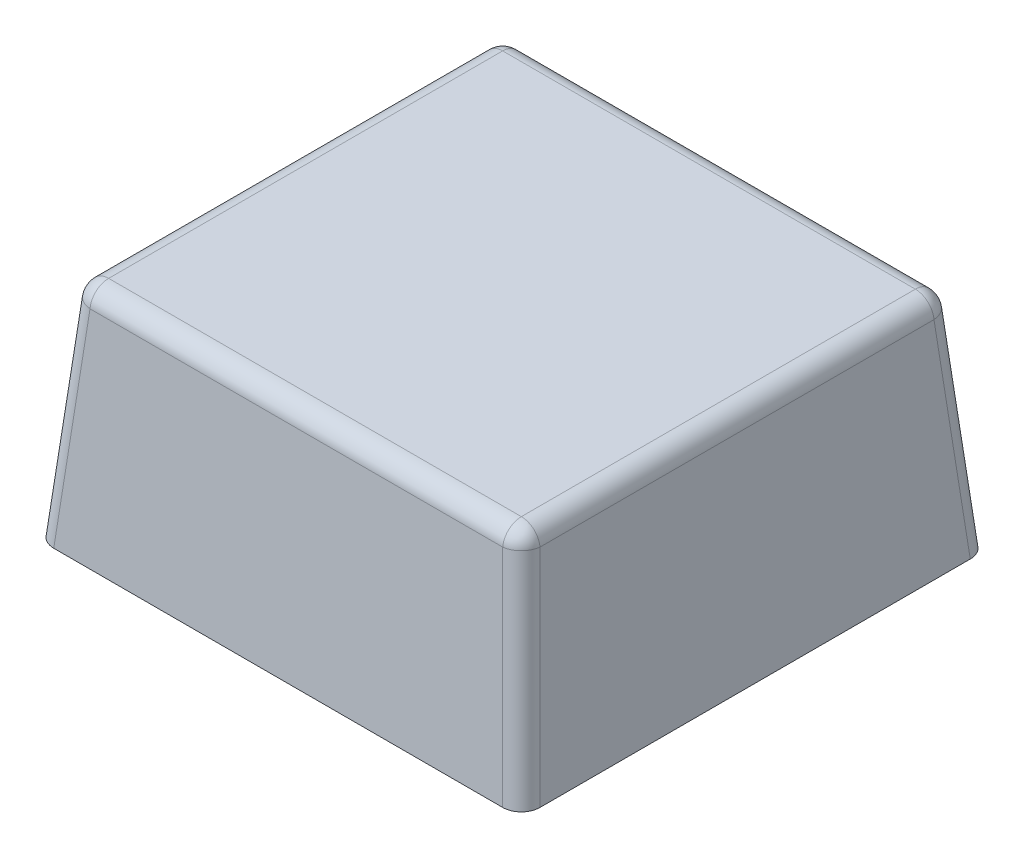
ISO-10303-21;
HEADER;
FILE_DESCRIPTION(('STEP AP214'),'2;1');
FILE_NAME('part.step','',(''),(''),'','','');
FILE_SCHEMA(('AUTOMOTIVE_DESIGN { 1 0 10303 214 1 1 1 1 }'));
ENDSEC;
DATA;
#1=APPLICATION_CONTEXT('core data for automotive mechanical design processes');
#2=APPLICATION_PROTOCOL_DEFINITION('international standard','automotive_design',2000,#1);
#3=PRODUCT_CONTEXT('',#1,'mechanical');
#4=PRODUCT('Part','Part','',(#3));
#5=PRODUCT_RELATED_PRODUCT_CATEGORY('part','',(#4));
#6=PRODUCT_DEFINITION_FORMATION('','',#4);
#7=PRODUCT_DEFINITION_CONTEXT('part definition',#1,'design');
#8=PRODUCT_DEFINITION('design','',#6,#7);
#9=PRODUCT_DEFINITION_SHAPE('','',#8);
#10=(LENGTH_UNIT() NAMED_UNIT(*) SI_UNIT(.MILLI.,.METRE.));
#11=(NAMED_UNIT(*) PLANE_ANGLE_UNIT() SI_UNIT($,.RADIAN.));
#12=(NAMED_UNIT(*) SI_UNIT($,.STERADIAN.) SOLID_ANGLE_UNIT());
#13=UNCERTAINTY_MEASURE_WITH_UNIT(LENGTH_MEASURE(1.E-05),#10,'distance_accuracy_value','');
#14=(GEOMETRIC_REPRESENTATION_CONTEXT(3) GLOBAL_UNCERTAINTY_ASSIGNED_CONTEXT((#13)) GLOBAL_UNIT_ASSIGNED_CONTEXT((#10,
#11,#12)) REPRESENTATION_CONTEXT('',''));
#15=CARTESIAN_POINT('',(0.,0.,0.));
#16=DIRECTION('',(0.,0.,1.));
#17=DIRECTION('',(1.,0.,0.));
#18=AXIS2_PLACEMENT_3D('',#15,#16,#17);
#19=CARTESIAN_POINT('',(0.,0.85,-0.526690243184));
#20=DIRECTION('',(-1.,0.,0.));
#21=DIRECTION('',(0.,0.,1.));
#22=AXIS2_PLACEMENT_3D('',#19,#20,#21);
#23=CYLINDRICAL_SURFACE('',#22,0.05);
#24=CARTESIAN_POINT('',(0.551690243184,0.85,-0.526690243184));
#25=DIRECTION('',(-1.,0.,0.));
#26=DIRECTION('',(0.,0.,-1.));
#27=AXIS2_PLACEMENT_3D('',#24,#25,#26);
#28=CIRCLE('',#27,0.05);
#29=CARTESIAN_POINT('',(0.551690243184,0.9,-0.526690243184));
#30=VERTEX_POINT('',#29);
#31=CARTESIAN_POINT('',(0.551690243184,0.854357787137,-0.576499978088));
#32=VERTEX_POINT('',#31);
#33=EDGE_CURVE('E20',#30,#32,#28,.T.);
#34=ORIENTED_EDGE('',*,*,#33,.T.);
#35=DIRECTION('',(1.,0.,0.));
#36=VECTOR('',#35,1.);
#37=CARTESIAN_POINT('',(0.597506801884,0.854357787137,-0.576499978088));
#38=LINE('',#37,#36);
#39=CARTESIAN_POINT('',(-0.551690243184,0.854357787137,-0.576499978088));
#40=VERTEX_POINT('',#39);
#41=EDGE_CURVE('E132',#40,#32,#38,.T.);
#42=ORIENTED_EDGE('',*,*,#41,.F.);
#43=CARTESIAN_POINT('',(-0.551690243184,0.85,-0.526690243184));
#44=DIRECTION('',(1.,0.,0.));
#45=DIRECTION('',(0.,0.,1.));
#46=AXIS2_PLACEMENT_3D('',#43,#44,#45);
#47=CIRCLE('',#46,0.05);
#48=CARTESIAN_POINT('',(-0.551690243184,0.9,-0.526690243184));
#49=VERTEX_POINT('',#48);
#50=EDGE_CURVE('E11',#40,#49,#47,.T.);
#51=ORIENTED_EDGE('',*,*,#50,.T.);
#52=DIRECTION('',(-1.,0.,0.));
#53=VECTOR('',#52,1.);
#54=CARTESIAN_POINT('',(-0.597506801884,0.9,-0.526690243184));
#55=LINE('',#54,#53);
#56=EDGE_CURVE('E114',#30,#49,#55,.T.);
#57=ORIENTED_EDGE('',*,*,#56,.F.);
#58=EDGE_LOOP('',(#34,#42,#51,#57));
#59=FACE_BOUND('',#58,.T.);
#60=ADVANCED_FACE('F17',(#59),#23,.T.);
#61=CARTESIAN_POINT('',(-0.551690243184,0.85,-0.526690243184));
#62=DIRECTION('',(0.,1.,0.));
#63=DIRECTION('',(1.,0.,0.));
#64=AXIS2_PLACEMENT_3D('',#61,#62,#63);
#65=SPHERICAL_SURFACE('',#64,0.05);
#66=CARTESIAN_POINT('',(-0.551690243184,0.85,-0.526690243184));
#67=DIRECTION('',(0.0868265938642471,0.992432509138969,0.0868265938642274));
#68=DIRECTION('',(0.,-0.0871557427476379,0.996194698091747));
#69=AXIS2_PLACEMENT_3D('',#66,#67,#68);
#70=CIRCLE('',#69,0.05);
#71=CARTESIAN_POINT('',(-0.601499978088,0.854357787137,-0.526690243184));
#72=VERTEX_POINT('',#71);
#73=EDGE_CURVE('E100',#40,#72,#70,.T.);
#74=ORIENTED_EDGE('',*,*,#73,.T.);
#75=CARTESIAN_POINT('',(-0.551690243184,0.85,-0.526690243184));
#76=DIRECTION('',(0.,0.,-1.));
#77=DIRECTION('',(0.,1.,0.));
#78=AXIS2_PLACEMENT_3D('',#75,#76,#77);
#79=CIRCLE('',#78,0.05);
#80=EDGE_CURVE('E111',#72,#49,#79,.T.);
#81=ORIENTED_EDGE('',*,*,#80,.T.);
#82=ORIENTED_EDGE('',*,*,#50,.F.);
#83=EDGE_LOOP('',(#74,#81,#82));
#84=FACE_BOUND('',#83,.T.);
#85=ADVANCED_FACE('F321',(#84),#65,.T.);
#86=CARTESIAN_POINT('',(0.551690243184,0.85,-0.526690243184));
#87=DIRECTION('',(0.,1.,0.));
#88=DIRECTION('',(1.,0.,0.));
#89=AXIS2_PLACEMENT_3D('',#86,#87,#88);
#90=SPHERICAL_SURFACE('',#89,0.05);
#91=CARTESIAN_POINT('',(0.551690243184,0.85,-0.526690243184));
#92=DIRECTION('',(0.,0.,-1.));
#93=DIRECTION('',(-1.,0.,0.));
#94=AXIS2_PLACEMENT_3D('',#91,#92,#93);
#95=CIRCLE('',#94,0.05);
#96=CARTESIAN_POINT('',(0.601499978088,0.854357787137,-0.526690243184));
#97=VERTEX_POINT('',#96);
#98=EDGE_CURVE('E92',#30,#97,#95,.T.);
#99=ORIENTED_EDGE('',*,*,#98,.T.);
#100=CARTESIAN_POINT('',(0.551690243184,0.85,-0.526690243184));
#101=DIRECTION('',(-0.0868265938642471,0.992432509138969,0.0868265938642274));
#102=DIRECTION('',(0.,-0.0871557427476379,0.996194698091747));
#103=AXIS2_PLACEMENT_3D('',#100,#101,#102);
#104=CIRCLE('',#103,0.05);
#105=EDGE_CURVE('E94',#97,#32,#104,.T.);
#106=ORIENTED_EDGE('',*,*,#105,.T.);
#107=ORIENTED_EDGE('',*,*,#33,.F.);
#108=EDGE_LOOP('',(#99,#106,#107));
#109=FACE_BOUND('',#108,.T.);
#110=ADVANCED_FACE('F91',(#109),#90,.T.);
#111=CARTESIAN_POINT('',(-0.591142201832,0.399062049208,-0.566142201832));
#112=DIRECTION('',(-0.0868265938642274,-0.992432509138969,-0.0868265938642471));
#113=DIRECTION('',(0.996194698091747,-0.0871557427476379,0.));
#114=AXIS2_PLACEMENT_3D('',#111,#112,#113);
#115=CYLINDRICAL_SURFACE('',#114,0.05);
#116=CARTESIAN_POINT('',(-0.65,0.3,-0.575190265095));
#117=CARTESIAN_POINT('',(-0.65,0.3,-0.604413846781));
#118=CARTESIAN_POINT('',(-0.629413846781,0.3,-0.625));
#119=CARTESIAN_POINT('',(-0.600190265095,0.3,-0.625));
#120=(BOUNDED_CURVE() B_SPLINE_CURVE(3,(#116,#117,#118,#119),.UNSPECIFIED.,.F.,
.F.) B_SPLINE_CURVE_WITH_KNOTS((4,4),(5.501585242055,7.064785372304),
.UNSPECIFIED.) CURVE() GEOMETRIC_REPRESENTATION_ITEM() RATIONAL_B_SPLINE_CURVE((1.,
0.806524890385,0.806524890385,1.)) REPRESENTATION_ITEM(''));
#121=CARTESIAN_POINT('',(-0.65,0.3,-0.575190265095));
#122=VERTEX_POINT('',#121);
#123=CARTESIAN_POINT('',(-0.600190265095,0.3,-0.625));
#124=VERTEX_POINT('',#123);
#125=EDGE_CURVE('E139',#122,#124,#120,.T.);
#126=ORIENTED_EDGE('',*,*,#125,.F.);
#127=DIRECTION('',(-0.0868265938642471,-0.992432509138967,-0.0868265938642471));
#128=VECTOR('',#127,1.);
#129=CARTESIAN_POINT('',(-0.640951936736,0.403419836345,-0.566142201832));
#130=LINE('',#129,#128);
#131=EDGE_CURVE('E229',#72,#122,#130,.T.);
#132=ORIENTED_EDGE('',*,*,#131,.F.);
#133=ORIENTED_EDGE('',*,*,#73,.F.);
#134=DIRECTION('',(0.0868265938642471,0.992432509138967,0.0868265938642471));
#135=VECTOR('',#134,1.);
#136=CARTESIAN_POINT('',(-0.590765258961,0.407728313066,-0.615574993866));
#137=LINE('',#136,#135);
#138=EDGE_CURVE('E197',#124,#40,#137,.T.);
#139=ORIENTED_EDGE('',*,*,#138,.F.);
#140=EDGE_LOOP('',(#126,#132,#133,#139));
#141=FACE_BOUND('',#140,.T.);
#142=ADVANCED_FACE('F224',(#141),#115,.T.);
#143=CARTESIAN_POINT('',(-0.551690243184,0.85,0.));
#144=DIRECTION('',(0.,0.,1.));
#145=DIRECTION('',(1.,0.,0.));
#146=AXIS2_PLACEMENT_3D('',#143,#144,#145);
#147=CYLINDRICAL_SURFACE('',#146,0.05);
#148=CARTESIAN_POINT('',(-0.551690243184,0.85,0.526690243184));
#149=DIRECTION('',(0.,0.,-1.));
#150=DIRECTION('',(1.,0.,0.));
#151=AXIS2_PLACEMENT_3D('',#148,#149,#150);
#152=CIRCLE('',#151,0.05);
#153=CARTESIAN_POINT('',(-0.601499978088,0.854357787137,0.526690243184));
#154=VERTEX_POINT('',#153);
#155=CARTESIAN_POINT('',(-0.551690243184,0.9,0.526690243184));
#156=VERTEX_POINT('',#155);
#157=EDGE_CURVE('E39',#154,#156,#152,.T.);
#158=ORIENTED_EDGE('',*,*,#157,.T.);
#159=DIRECTION('',(0.,0.,1.));
#160=VECTOR('',#159,1.);
#161=CARTESIAN_POINT('',(-0.551690243184,0.9,0.572506801884));
#162=LINE('',#161,#160);
#163=EDGE_CURVE('E119',#49,#156,#162,.T.);
#164=ORIENTED_EDGE('',*,*,#163,.F.);
#165=ORIENTED_EDGE('',*,*,#80,.F.);
#166=DIRECTION('',(0.,0.,-1.));
#167=VECTOR('',#166,1.);
#168=CARTESIAN_POINT('',(-0.601499978088,0.854357787137,-0.572506801884));
#169=LINE('',#168,#167);
#170=EDGE_CURVE('E238',#154,#72,#169,.T.);
#171=ORIENTED_EDGE('',*,*,#170,.F.);
#172=EDGE_LOOP('',(#158,#164,#165,#171));
#173=FACE_BOUND('',#172,.T.);
#174=ADVANCED_FACE('F342',(#173),#147,.T.);
#175=CARTESIAN_POINT('',(0.551690243184,0.85,0.));
#176=DIRECTION('',(0.,0.,-1.));
#177=DIRECTION('',(-1.,0.,0.));
#178=AXIS2_PLACEMENT_3D('',#175,#176,#177);
#179=CYLINDRICAL_SURFACE('',#178,0.05);
#180=CARTESIAN_POINT('',(0.551690243184,0.85,0.526690243184));
#181=DIRECTION('',(0.,0.,-1.));
#182=DIRECTION('',(0.,-1.,0.));
#183=AXIS2_PLACEMENT_3D('',#180,#181,#182);
#184=CIRCLE('',#183,0.05);
#185=CARTESIAN_POINT('',(0.551690243184,0.9,0.526690243184));
#186=VERTEX_POINT('',#185);
#187=CARTESIAN_POINT('',(0.601499978088,0.854357787137,0.526690243184));
#188=VERTEX_POINT('',#187);
#189=EDGE_CURVE('E142',#186,#188,#184,.T.);
#190=ORIENTED_EDGE('',*,*,#189,.T.);
#191=DIRECTION('',(0.,0.,1.));
#192=VECTOR('',#191,1.);
#193=CARTESIAN_POINT('',(0.601499978088,0.854357787137,0.572506801884));
#194=LINE('',#193,#192);
#195=EDGE_CURVE('E108',#97,#188,#194,.T.);
#196=ORIENTED_EDGE('',*,*,#195,.F.);
#197=ORIENTED_EDGE('',*,*,#98,.F.);
#198=DIRECTION('',(0.,0.,-1.));
#199=VECTOR('',#198,1.);
#200=CARTESIAN_POINT('',(0.551690243184,0.9,-0.572506801884));
#201=LINE('',#200,#199);
#202=EDGE_CURVE('E106',#186,#30,#201,.T.);
#203=ORIENTED_EDGE('',*,*,#202,.F.);
#204=EDGE_LOOP('',(#190,#196,#197,#203));
#205=FACE_BOUND('',#204,.T.);
#206=ADVANCED_FACE('F104',(#205),#179,.T.);
#207=CARTESIAN_POINT('',(0.600565773584,0.291350131197,-0.575565773584));
#208=DIRECTION('',(0.0868265938642471,-0.992432509138969,-0.0868265938642274));
#209=DIRECTION('',(0.,0.0871557427476379,-0.996194698091747));
#210=AXIS2_PLACEMENT_3D('',#207,#208,#209);
#211=CYLINDRICAL_SURFACE('',#210,0.05);
#212=CARTESIAN_POINT('',(0.600190265095,0.3,-0.625));
#213=CARTESIAN_POINT('',(0.629413846781,0.3,-0.625));
#214=CARTESIAN_POINT('',(0.65,0.3,-0.604413846781));
#215=CARTESIAN_POINT('',(0.65,0.3,-0.575190265095));
#216=(BOUNDED_CURVE() B_SPLINE_CURVE(3,(#212,#213,#214,#215),.UNSPECIFIED.,.F.,
.F.) B_SPLINE_CURVE_WITH_KNOTS((4,4),(5.501585242055,7.064785372304),
.UNSPECIFIED.) CURVE() GEOMETRIC_REPRESENTATION_ITEM() RATIONAL_B_SPLINE_CURVE((1.,
0.806524890385,0.806524890385,1.)) REPRESENTATION_ITEM(''));
#217=CARTESIAN_POINT('',(0.600190265095,0.3,-0.625));
#218=VERTEX_POINT('',#217);
#219=CARTESIAN_POINT('',(0.65,0.3,-0.575190265095));
#220=VERTEX_POINT('',#219);
#221=EDGE_CURVE('E147',#218,#220,#216,.T.);
#222=ORIENTED_EDGE('',*,*,#221,.F.);
#223=DIRECTION('',(0.0868265938642471,-0.992432509138967,-0.0868265938642471));
#224=VECTOR('',#223,1.);
#225=CARTESIAN_POINT('',(0.600565773584,0.295707918334,-0.625375508489));
#226=LINE('',#225,#224);
#227=EDGE_CURVE('E126',#32,#218,#226,.T.);
#228=ORIENTED_EDGE('',*,*,#227,.F.);
#229=ORIENTED_EDGE('',*,*,#105,.F.);
#230=DIRECTION('',(-0.0868265938642471,0.992432509138967,0.0868265938642471));
#231=VECTOR('',#230,1.);
#232=CARTESIAN_POINT('',(0.640951936736,0.403419836345,-0.566142201832));
#233=LINE('',#232,#231);
#234=EDGE_CURVE('E201',#220,#97,#233,.T.);
#235=ORIENTED_EDGE('',*,*,#234,.F.);
#236=EDGE_LOOP('',(#222,#228,#229,#235));
#237=FACE_BOUND('',#236,.T.);
#238=ADVANCED_FACE('F353',(#237),#211,.T.);
#239=CARTESIAN_POINT('',(-0.551690243184,0.85,0.526690243184));
#240=DIRECTION('',(0.,1.,0.));
#241=DIRECTION('',(1.,0.,0.));
#242=AXIS2_PLACEMENT_3D('',#239,#240,#241);
#243=SPHERICAL_SURFACE('',#242,0.05);
#244=CARTESIAN_POINT('',(-0.551690243184,0.85,0.526690243184));
#245=DIRECTION('',(0.0868265938642471,0.992432509138969,-0.0868265938642274));
#246=DIRECTION('',(0.,0.0871557427476379,0.996194698091747));
#247=AXIS2_PLACEMENT_3D('',#244,#245,#246);
#248=CIRCLE('',#247,0.05);
#249=CARTESIAN_POINT('',(-0.551690243184,0.854357787137,0.576499978088));
#250=VERTEX_POINT('',#249);
#251=EDGE_CURVE('E176',#154,#250,#248,.T.);
#252=ORIENTED_EDGE('',*,*,#251,.T.);
#253=CARTESIAN_POINT('',(-0.551690243184,0.85,0.526690243184));
#254=DIRECTION('',(-1.,0.,0.));
#255=DIRECTION('',(0.,0.,1.));
#256=AXIS2_PLACEMENT_3D('',#253,#254,#255);
#257=CIRCLE('',#256,0.05);
#258=EDGE_CURVE('E172',#250,#156,#257,.T.);
#259=ORIENTED_EDGE('',*,*,#258,.T.);
#260=ORIENTED_EDGE('',*,*,#157,.F.);
#261=EDGE_LOOP('',(#252,#259,#260));
#262=FACE_BOUND('',#261,.T.);
#263=ADVANCED_FACE('F347',(#262),#243,.T.);
#264=CARTESIAN_POINT('',(0.551690243184,0.85,0.526690243184));
#265=DIRECTION('',(0.,1.,0.));
#266=DIRECTION('',(1.,0.,0.));
#267=AXIS2_PLACEMENT_3D('',#264,#265,#266);
#268=SPHERICAL_SURFACE('',#267,0.05);
#269=CARTESIAN_POINT('',(0.551690243184,0.85,0.526690243184));
#270=DIRECTION('',(1.,0.,0.));
#271=DIRECTION('',(0.,0.,-1.));
#272=AXIS2_PLACEMENT_3D('',#269,#270,#271);
#273=CIRCLE('',#272,0.05);
#274=CARTESIAN_POINT('',(0.551690243184,0.854357787137,0.576499978088));
#275=VERTEX_POINT('',#274);
#276=EDGE_CURVE('E175',#186,#275,#273,.T.);
#277=ORIENTED_EDGE('',*,*,#276,.T.);
#278=CARTESIAN_POINT('',(0.551690243184,0.85,0.526690243184));
#279=DIRECTION('',(-0.0868265938642471,0.992432509138969,-0.0868265938642274));
#280=DIRECTION('',(0.,0.0871557427476379,0.996194698091747));
#281=AXIS2_PLACEMENT_3D('',#278,#279,#280);
#282=CIRCLE('',#281,0.05);
#283=EDGE_CURVE('E165',#275,#188,#282,.T.);
#284=ORIENTED_EDGE('',*,*,#283,.T.);
#285=ORIENTED_EDGE('',*,*,#189,.F.);
#286=EDGE_LOOP('',(#277,#284,#285));
#287=FACE_BOUND('',#286,.T.);
#288=ADVANCED_FACE('F352',(#287),#268,.T.);
#289=CARTESIAN_POINT('',(-0.590765258961,0.403370525928,0.565765258961));
#290=DIRECTION('',(-0.0868265938642471,-0.992432509138969,0.0868265938642274));
#291=DIRECTION('',(0.,-0.0871557427476379,-0.996194698091747));
#292=AXIS2_PLACEMENT_3D('',#289,#290,#291);
#293=CYLINDRICAL_SURFACE('',#292,0.05);
#294=CARTESIAN_POINT('',(-0.600190265095,0.3,0.625));
#295=CARTESIAN_POINT('',(-0.629413846781,0.3,0.625));
#296=CARTESIAN_POINT('',(-0.65,0.3,0.604413846781));
#297=CARTESIAN_POINT('',(-0.65,0.3,0.575190265095));
#298=(BOUNDED_CURVE() B_SPLINE_CURVE(3,(#294,#295,#296,#297),.UNSPECIFIED.,.F.,
.F.) B_SPLINE_CURVE_WITH_KNOTS((4,4),(5.501585242055,7.064785372304),
.UNSPECIFIED.) CURVE() GEOMETRIC_REPRESENTATION_ITEM() RATIONAL_B_SPLINE_CURVE((1.,
0.806524890385,0.806524890385,1.)) REPRESENTATION_ITEM(''));
#299=CARTESIAN_POINT('',(-0.600190265095,0.3,0.625));
#300=VERTEX_POINT('',#299);
#301=CARTESIAN_POINT('',(-0.65,0.3,0.575190265095));
#302=VERTEX_POINT('',#301);
#303=EDGE_CURVE('E156',#300,#302,#298,.T.);
#304=ORIENTED_EDGE('',*,*,#303,.F.);
#305=DIRECTION('',(-0.0868265938642471,-0.992432509138967,0.0868265938642471));
#306=VECTOR('',#305,1.);
#307=CARTESIAN_POINT('',(-0.590765258961,0.407728313066,0.615574993866));
#308=LINE('',#307,#306);
#309=EDGE_CURVE('E269',#250,#300,#308,.T.);
#310=ORIENTED_EDGE('',*,*,#309,.F.);
#311=ORIENTED_EDGE('',*,*,#251,.F.);
#312=DIRECTION('',(0.0868265938642471,0.992432509138967,-0.0868265938642471));
#313=VECTOR('',#312,1.);
#314=CARTESIAN_POINT('',(-0.650375508489,0.295707918334,0.575565773584));
#315=LINE('',#314,#313);
#316=EDGE_CURVE('E243',#302,#154,#315,.T.);
#317=ORIENTED_EDGE('',*,*,#316,.F.);
#318=EDGE_LOOP('',(#304,#310,#311,#317));
#319=FACE_BOUND('',#318,.T.);
#320=ADVANCED_FACE('F301',(#319),#293,.T.);
#321=CARTESIAN_POINT('',(0.,0.85,0.526690243184));
#322=DIRECTION('',(1.,0.,0.));
#323=DIRECTION('',(0.,0.,-1.));
#324=AXIS2_PLACEMENT_3D('',#321,#322,#323);
#325=CYLINDRICAL_SURFACE('',#324,0.05);
#326=ORIENTED_EDGE('',*,*,#258,.F.);
#327=DIRECTION('',(-1.,0.,0.));
#328=VECTOR('',#327,1.);
#329=CARTESIAN_POINT('',(-0.597506801884,0.854357787137,0.576499978088));
#330=LINE('',#329,#328);
#331=EDGE_CURVE('E261',#275,#250,#330,.T.);
#332=ORIENTED_EDGE('',*,*,#331,.F.);
#333=ORIENTED_EDGE('',*,*,#276,.F.);
#334=DIRECTION('',(1.,0.,0.));
#335=VECTOR('',#334,1.);
#336=CARTESIAN_POINT('',(0.597506801884,0.9,0.526690243184));
#337=LINE('',#336,#335);
#338=EDGE_CURVE('E124',#156,#186,#337,.T.);
#339=ORIENTED_EDGE('',*,*,#338,.F.);
#340=EDGE_LOOP('',(#326,#332,#333,#339));
#341=FACE_BOUND('',#340,.T.);
#342=ADVANCED_FACE('F293',(#341),#325,.T.);
#343=CARTESIAN_POINT('',(0.600565773584,0.291350131197,0.575565773584));
#344=DIRECTION('',(0.0868265938642274,-0.992432509138969,0.0868265938642471));
#345=DIRECTION('',(0.996194698091747,0.0871557427476379,0.));
#346=AXIS2_PLACEMENT_3D('',#343,#344,#345);
#347=CYLINDRICAL_SURFACE('',#346,0.05);
#348=CARTESIAN_POINT('',(0.65,0.3,0.575190265095));
#349=CARTESIAN_POINT('',(0.65,0.3,0.604413846781));
#350=CARTESIAN_POINT('',(0.629413846781,0.3,0.625));
#351=CARTESIAN_POINT('',(0.600190265095,0.3,0.625));
#352=(BOUNDED_CURVE() B_SPLINE_CURVE(3,(#348,#349,#350,#351),.UNSPECIFIED.,.F.,
.F.) B_SPLINE_CURVE_WITH_KNOTS((4,4),(5.501585242055,7.064785372304),
.UNSPECIFIED.) CURVE() GEOMETRIC_REPRESENTATION_ITEM() RATIONAL_B_SPLINE_CURVE((1.,
0.806524890385,0.806524890385,1.)) REPRESENTATION_ITEM(''));
#353=CARTESIAN_POINT('',(0.65,0.3,0.575190265095));
#354=VERTEX_POINT('',#353);
#355=CARTESIAN_POINT('',(0.600190265095,0.3,0.625));
#356=VERTEX_POINT('',#355);
#357=EDGE_CURVE('E155',#354,#356,#352,.T.);
#358=ORIENTED_EDGE('',*,*,#357,.F.);
#359=DIRECTION('',(0.0868265938642471,-0.992432509138967,0.0868265938642471));
#360=VECTOR('',#359,1.);
#361=CARTESIAN_POINT('',(0.650375508489,0.295707918334,0.575565773584));
#362=LINE('',#361,#360);
#363=EDGE_CURVE('E205',#188,#354,#362,.T.);
#364=ORIENTED_EDGE('',*,*,#363,.F.);
#365=ORIENTED_EDGE('',*,*,#283,.F.);
#366=DIRECTION('',(-0.0868265938642471,0.992432509138967,-0.0868265938642471));
#367=VECTOR('',#366,1.);
#368=CARTESIAN_POINT('',(0.600565773584,0.295707918334,0.625375508489));
#369=LINE('',#368,#367);
#370=EDGE_CURVE('E265',#356,#275,#369,.T.);
#371=ORIENTED_EDGE('',*,*,#370,.F.);
#372=EDGE_LOOP('',(#358,#364,#365,#371));
#373=FACE_BOUND('',#372,.T.);
#374=ADVANCED_FACE('F371',(#373),#347,.T.);
#375=CARTESIAN_POINT('',(0.,0.3,0.));
#376=DIRECTION('',(0.,1.,0.));
#377=DIRECTION('',(1.,0.,0.));
#378=AXIS2_PLACEMENT_3D('',#375,#376,#377);
#379=PLANE('',#378);
#380=DIRECTION('',(0.,0.,1.));
#381=VECTOR('',#380,1.);
#382=CARTESIAN_POINT('',(-0.65,0.3,0.625));
#383=LINE('',#382,#381);
#384=EDGE_CURVE('E237',#122,#302,#383,.T.);
#385=ORIENTED_EDGE('',*,*,#384,.F.);
#386=ORIENTED_EDGE('',*,*,#125,.T.);
#387=DIRECTION('',(-1.,0.,0.));
#388=VECTOR('',#387,1.);
#389=CARTESIAN_POINT('',(0.65,0.3,-0.625));
#390=LINE('',#389,#388);
#391=EDGE_CURVE('E209',#218,#124,#390,.T.);
#392=ORIENTED_EDGE('',*,*,#391,.F.);
#393=ORIENTED_EDGE('',*,*,#221,.T.);
#394=DIRECTION('',(0.,0.,-1.));
#395=VECTOR('',#394,1.);
#396=CARTESIAN_POINT('',(0.65,0.3,0.625));
#397=LINE('',#396,#395);
#398=EDGE_CURVE('E204',#354,#220,#397,.T.);
#399=ORIENTED_EDGE('',*,*,#398,.F.);
#400=ORIENTED_EDGE('',*,*,#357,.T.);
#401=DIRECTION('',(1.,0.,0.));
#402=VECTOR('',#401,1.);
#403=CARTESIAN_POINT('',(0.65,0.3,0.625));
#404=LINE('',#403,#402);
#405=EDGE_CURVE('E273',#300,#356,#404,.T.);
#406=ORIENTED_EDGE('',*,*,#405,.F.);
#407=ORIENTED_EDGE('',*,*,#303,.T.);
#408=EDGE_LOOP('',(#385,#386,#392,#393,#399,#400,#406,#407));
#409=FACE_BOUND('',#408,.T.);
#410=ADVANCED_FACE('F387',(#409),#379,.F.);
#411=CARTESIAN_POINT('',(0.,0.9,0.));
#412=DIRECTION('',(0.,1.,0.));
#413=DIRECTION('',(1.,0.,0.));
#414=AXIS2_PLACEMENT_3D('',#411,#412,#413);
#415=PLANE('',#414);
#416=ORIENTED_EDGE('',*,*,#202,.T.);
#417=ORIENTED_EDGE('',*,*,#56,.T.);
#418=ORIENTED_EDGE('',*,*,#163,.T.);
#419=ORIENTED_EDGE('',*,*,#338,.T.);
#420=EDGE_LOOP('',(#416,#417,#418,#419));
#421=FACE_BOUND('',#420,.T.);
#422=ADVANCED_FACE('F122',(#421),#415,.T.);
#423=CARTESIAN_POINT('',(0.65,0.3,-0.625));
#424=DIRECTION('',(0.,0.0871557427476379,-0.996194698091747));
#425=DIRECTION('',(-1.,0.,0.));
#426=AXIS2_PLACEMENT_3D('',#423,#424,#425);
#427=PLANE('',#426);
#428=ORIENTED_EDGE('',*,*,#391,.T.);
#429=ORIENTED_EDGE('',*,*,#138,.T.);
#430=ORIENTED_EDGE('',*,*,#41,.T.);
#431=ORIENTED_EDGE('',*,*,#227,.T.);
#432=EDGE_LOOP('',(#428,#429,#430,#431));
#433=FACE_BOUND('',#432,.T.);
#434=ADVANCED_FACE('F220',(#433),#427,.T.);
#435=CARTESIAN_POINT('',(0.65,0.3,0.625));
#436=DIRECTION('',(0.996194698091747,0.0871557427476379,0.));
#437=DIRECTION('',(0.,0.,-1.));
#438=AXIS2_PLACEMENT_3D('',#435,#436,#437);
#439=PLANE('',#438);
#440=ORIENTED_EDGE('',*,*,#398,.T.);
#441=ORIENTED_EDGE('',*,*,#234,.T.);
#442=ORIENTED_EDGE('',*,*,#195,.T.);
#443=ORIENTED_EDGE('',*,*,#363,.T.);
#444=EDGE_LOOP('',(#440,#441,#442,#443));
#445=FACE_BOUND('',#444,.T.);
#446=ADVANCED_FACE('F416',(#445),#439,.T.);
#447=CARTESIAN_POINT('',(0.65,0.3,0.625));
#448=DIRECTION('',(0.,0.0871557427476379,0.996194698091747));
#449=DIRECTION('',(1.,0.,0.));
#450=AXIS2_PLACEMENT_3D('',#447,#448,#449);
#451=PLANE('',#450);
#452=ORIENTED_EDGE('',*,*,#331,.T.);
#453=ORIENTED_EDGE('',*,*,#309,.T.);
#454=ORIENTED_EDGE('',*,*,#405,.T.);
#455=ORIENTED_EDGE('',*,*,#370,.T.);
#456=EDGE_LOOP('',(#452,#453,#454,#455));
#457=FACE_BOUND('',#456,.T.);
#458=ADVANCED_FACE('F282',(#457),#451,.T.);
#459=CARTESIAN_POINT('',(-0.65,0.3,0.625));
#460=DIRECTION('',(-0.996194698091747,0.0871557427476379,0.));
#461=DIRECTION('',(0.,0.,1.));
#462=AXIS2_PLACEMENT_3D('',#459,#460,#461);
#463=PLANE('',#462);
#464=ORIENTED_EDGE('',*,*,#170,.T.);
#465=ORIENTED_EDGE('',*,*,#131,.T.);
#466=ORIENTED_EDGE('',*,*,#384,.T.);
#467=ORIENTED_EDGE('',*,*,#316,.T.);
#468=EDGE_LOOP('',(#464,#465,#466,#467));
#469=FACE_BOUND('',#468,.T.);
#470=ADVANCED_FACE('F241',(#469),#463,.T.);
#471=CLOSED_SHELL('',(#60,#85,#110,#142,#174,#206,#238,#263,#288,#320,#342,#374,#410,#422,#434,
#446,#458,#470));
#472=MANIFOLD_SOLID_BREP('B1',#471);
#473=ADVANCED_BREP_SHAPE_REPRESENTATION('',(#18,#472),#14);
#474=SHAPE_DEFINITION_REPRESENTATION(#9,#473);
ENDSEC;
END-ISO-10303-21;
